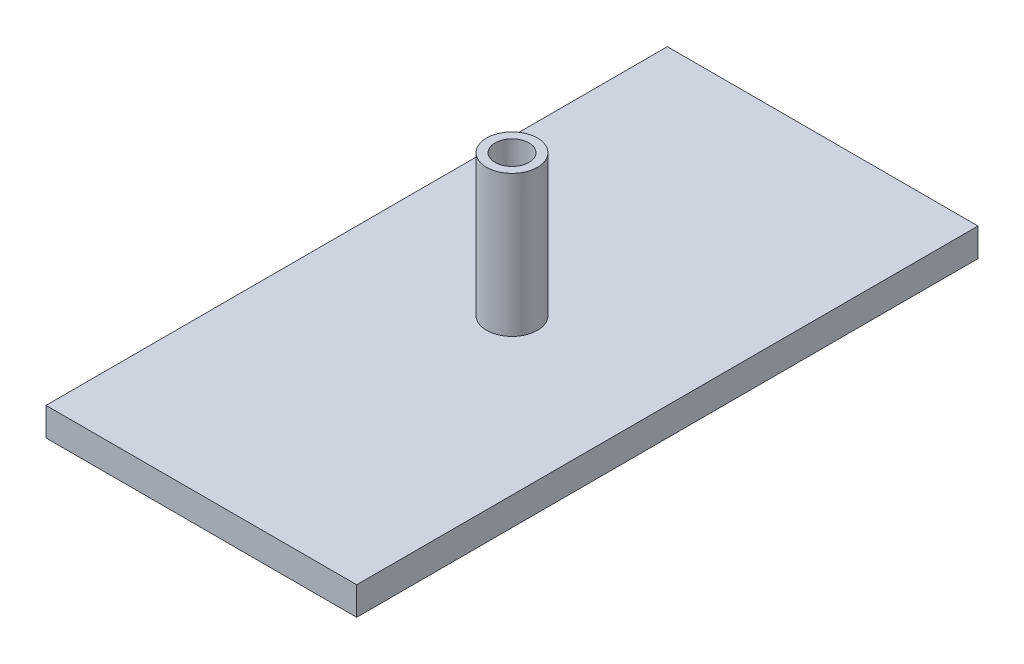
ISO-10303-21;
HEADER;
FILE_DESCRIPTION(('STEP AP214'),'2;1');
FILE_NAME('part.step','',(''),(''),'','','');
FILE_SCHEMA(('AUTOMOTIVE_DESIGN { 1 0 10303 214 1 1 1 1 }'));
ENDSEC;
DATA;
#1=APPLICATION_CONTEXT('core data for automotive mechanical design processes');
#2=APPLICATION_PROTOCOL_DEFINITION('international standard','automotive_design',2000,#1);
#3=PRODUCT_CONTEXT('',#1,'mechanical');
#4=PRODUCT('Part','Part','',(#3));
#5=PRODUCT_RELATED_PRODUCT_CATEGORY('part','',(#4));
#6=PRODUCT_DEFINITION_FORMATION('','',#4);
#7=PRODUCT_DEFINITION_CONTEXT('part definition',#1,'design');
#8=PRODUCT_DEFINITION('design','',#6,#7);
#9=PRODUCT_DEFINITION_SHAPE('','',#8);
#10=(LENGTH_UNIT() NAMED_UNIT(*) SI_UNIT(.MILLI.,.METRE.));
#11=(NAMED_UNIT(*) PLANE_ANGLE_UNIT() SI_UNIT($,.RADIAN.));
#12=(NAMED_UNIT(*) SI_UNIT($,.STERADIAN.) SOLID_ANGLE_UNIT());
#13=UNCERTAINTY_MEASURE_WITH_UNIT(LENGTH_MEASURE(1.E-05),#10,'distance_accuracy_value','');
#14=(GEOMETRIC_REPRESENTATION_CONTEXT(3) GLOBAL_UNCERTAINTY_ASSIGNED_CONTEXT((#13)) GLOBAL_UNIT_ASSIGNED_CONTEXT((#10,
#11,#12)) REPRESENTATION_CONTEXT('',''));
#15=CARTESIAN_POINT('',(0.,0.,0.));
#16=DIRECTION('',(0.,0.,1.));
#17=DIRECTION('',(1.,0.,0.));
#18=AXIS2_PLACEMENT_3D('',#15,#16,#17);
#19=CARTESIAN_POINT('',(0.,5.,0.));
#20=DIRECTION('',(-1.,0.,0.));
#21=DIRECTION('',(0.,0.,1.));
#22=AXIS2_PLACEMENT_3D('',#19,#20,#21);
#23=PLANE('',#22);
#24=DIRECTION('',(0.,0.,-1.));
#25=VECTOR('',#24,1.);
#26=CARTESIAN_POINT('',(0.,0.,0.));
#27=LINE('',#26,#25);
#28=CARTESIAN_POINT('',(0.,0.,0.));
#29=VERTEX_POINT('',#28);
#30=CARTESIAN_POINT('',(0.,0.,-110.));
#31=VERTEX_POINT('',#30);
#32=EDGE_CURVE('E105',#29,#31,#27,.T.);
#33=ORIENTED_EDGE('',*,*,#32,.F.);
#34=DIRECTION('',(0.,-1.,0.));
#35=VECTOR('',#34,1.);
#36=CARTESIAN_POINT('',(0.,5.,0.));
#37=LINE('',#36,#35);
#38=CARTESIAN_POINT('',(0.,5.,0.));
#39=VERTEX_POINT('',#38);
#40=EDGE_CURVE('E45',#39,#29,#37,.T.);
#41=ORIENTED_EDGE('',*,*,#40,.F.);
#42=DIRECTION('',(0.,0.,-1.));
#43=VECTOR('',#42,1.);
#44=CARTESIAN_POINT('',(0.,5.,0.));
#45=LINE('',#44,#43);
#46=CARTESIAN_POINT('',(0.,5.,-110.));
#47=VERTEX_POINT('',#46);
#48=EDGE_CURVE('E99',#39,#47,#45,.T.);
#49=ORIENTED_EDGE('',*,*,#48,.T.);
#50=DIRECTION('',(0.,-1.,0.));
#51=VECTOR('',#50,1.);
#52=CARTESIAN_POINT('',(0.,5.,-110.));
#53=LINE('',#52,#51);
#54=EDGE_CURVE('E77',#47,#31,#53,.T.);
#55=ORIENTED_EDGE('',*,*,#54,.T.);
#56=EDGE_LOOP('',(#33,#41,#49,#55));
#57=FACE_BOUND('',#56,.T.);
#58=ADVANCED_FACE('F37',(#57),#23,.T.);
#59=CARTESIAN_POINT('',(0.,5.,0.));
#60=DIRECTION('',(0.,0.,-1.));
#61=DIRECTION('',(-1.,0.,0.));
#62=AXIS2_PLACEMENT_3D('',#59,#60,#61);
#63=PLANE('',#62);
#64=DIRECTION('',(1.,0.,0.));
#65=VECTOR('',#64,1.);
#66=CARTESIAN_POINT('',(0.,0.,0.));
#67=LINE('',#66,#65);
#68=CARTESIAN_POINT('',(55.,0.,0.));
#69=VERTEX_POINT('',#68);
#70=EDGE_CURVE('E69',#29,#69,#67,.T.);
#71=ORIENTED_EDGE('',*,*,#70,.T.);
#72=DIRECTION('',(0.,-1.,0.));
#73=VECTOR('',#72,1.);
#74=CARTESIAN_POINT('',(55.,5.,0.));
#75=LINE('',#74,#73);
#76=CARTESIAN_POINT('',(55.,5.,0.));
#77=VERTEX_POINT('',#76);
#78=EDGE_CURVE('E96',#77,#69,#75,.T.);
#79=ORIENTED_EDGE('',*,*,#78,.F.);
#80=DIRECTION('',(1.,0.,0.));
#81=VECTOR('',#80,1.);
#82=CARTESIAN_POINT('',(0.,5.,0.));
#83=LINE('',#82,#81);
#84=EDGE_CURVE('E87',#39,#77,#83,.T.);
#85=ORIENTED_EDGE('',*,*,#84,.F.);
#86=ORIENTED_EDGE('',*,*,#40,.T.);
#87=EDGE_LOOP('',(#71,#79,#85,#86));
#88=FACE_BOUND('',#87,.T.);
#89=ADVANCED_FACE('F130',(#88),#63,.F.);
#90=CARTESIAN_POINT('',(55.,5.,0.));
#91=DIRECTION('',(-1.,0.,0.));
#92=DIRECTION('',(0.,0.,1.));
#93=AXIS2_PLACEMENT_3D('',#90,#91,#92);
#94=PLANE('',#93);
#95=DIRECTION('',(0.,0.,-1.));
#96=VECTOR('',#95,1.);
#97=CARTESIAN_POINT('',(55.,0.,0.));
#98=LINE('',#97,#96);
#99=CARTESIAN_POINT('',(55.,0.,-110.));
#100=VERTEX_POINT('',#99);
#101=EDGE_CURVE('E94',#69,#100,#98,.T.);
#102=ORIENTED_EDGE('',*,*,#101,.T.);
#103=DIRECTION('',(0.,-1.,0.));
#104=VECTOR('',#103,1.);
#105=CARTESIAN_POINT('',(55.,5.,-110.));
#106=LINE('',#105,#104);
#107=CARTESIAN_POINT('',(55.,5.,-110.));
#108=VERTEX_POINT('',#107);
#109=EDGE_CURVE('E91',#108,#100,#106,.T.);
#110=ORIENTED_EDGE('',*,*,#109,.F.);
#111=DIRECTION('',(0.,0.,-1.));
#112=VECTOR('',#111,1.);
#113=CARTESIAN_POINT('',(55.,5.,0.));
#114=LINE('',#113,#112);
#115=EDGE_CURVE('E82',#77,#108,#114,.T.);
#116=ORIENTED_EDGE('',*,*,#115,.F.);
#117=ORIENTED_EDGE('',*,*,#78,.T.);
#118=EDGE_LOOP('',(#102,#110,#116,#117));
#119=FACE_BOUND('',#118,.T.);
#120=ADVANCED_FACE('F92',(#119),#94,.F.);
#121=CARTESIAN_POINT('',(0.,5.,-110.));
#122=DIRECTION('',(0.,0.,-1.));
#123=DIRECTION('',(-1.,0.,0.));
#124=AXIS2_PLACEMENT_3D('',#121,#122,#123);
#125=PLANE('',#124);
#126=DIRECTION('',(1.,0.,0.));
#127=VECTOR('',#126,1.);
#128=CARTESIAN_POINT('',(0.,0.,-110.));
#129=LINE('',#128,#127);
#130=EDGE_CURVE('E108',#31,#100,#129,.T.);
#131=ORIENTED_EDGE('',*,*,#130,.F.);
#132=ORIENTED_EDGE('',*,*,#54,.F.);
#133=DIRECTION('',(1.,0.,0.));
#134=VECTOR('',#133,1.);
#135=CARTESIAN_POINT('',(0.,5.,-110.));
#136=LINE('',#135,#134);
#137=EDGE_CURVE('E86',#47,#108,#136,.T.);
#138=ORIENTED_EDGE('',*,*,#137,.T.);
#139=ORIENTED_EDGE('',*,*,#109,.T.);
#140=EDGE_LOOP('',(#131,#132,#138,#139));
#141=FACE_BOUND('',#140,.T.);
#142=ADVANCED_FACE('F98',(#141),#125,.T.);
#143=CARTESIAN_POINT('',(0.,5.,0.));
#144=DIRECTION('',(0.,-1.,0.));
#145=DIRECTION('',(0.,0.,-1.));
#146=AXIS2_PLACEMENT_3D('',#143,#144,#145);
#147=PLANE('',#146);
#148=CARTESIAN_POINT('',(27.5,5.,-55.));
#149=DIRECTION('',(0.,-1.,0.));
#150=DIRECTION('',(0.,0.,-1.));
#151=AXIS2_PLACEMENT_3D('',#148,#149,#150);
#152=CIRCLE('',#151,4.50000000000001);
#153=CARTESIAN_POINT('',(27.5,5.,-59.5));
#154=VERTEX_POINT('',#153);
#155=EDGE_CURVE('E11',#154,#154,#152,.F.);
#156=ORIENTED_EDGE('',*,*,#155,.F.);
#157=EDGE_LOOP('',(#156));
#158=FACE_BOUND('',#157,.T.);
#159=ORIENTED_EDGE('',*,*,#48,.F.);
#160=ORIENTED_EDGE('',*,*,#84,.T.);
#161=ORIENTED_EDGE('',*,*,#115,.T.);
#162=ORIENTED_EDGE('',*,*,#137,.F.);
#163=EDGE_LOOP('',(#159,#160,#161,#162));
#164=FACE_BOUND('',#163,.T.);
#165=ADVANCED_FACE('F85',(#158,#164),#147,.F.);
#166=CARTESIAN_POINT('',(0.,0.,0.));
#167=DIRECTION('',(0.,-1.,0.));
#168=DIRECTION('',(0.,0.,-1.));
#169=AXIS2_PLACEMENT_3D('',#166,#167,#168);
#170=PLANE('',#169);
#171=ORIENTED_EDGE('',*,*,#32,.T.);
#172=ORIENTED_EDGE('',*,*,#130,.T.);
#173=ORIENTED_EDGE('',*,*,#101,.F.);
#174=ORIENTED_EDGE('',*,*,#70,.F.);
#175=EDGE_LOOP('',(#171,#172,#173,#174));
#176=FACE_BOUND('',#175,.T.);
#177=ADVANCED_FACE('F115',(#176),#170,.T.);
#178=CARTESIAN_POINT('',(27.5,30.,-55.));
#179=DIRECTION('',(0.,-1.,0.));
#180=DIRECTION('',(0.,0.,-1.));
#181=AXIS2_PLACEMENT_3D('',#178,#179,#180);
#182=CYLINDRICAL_SURFACE('',#181,4.50000000000001);
#183=CARTESIAN_POINT('',(27.5,30.,-55.));
#184=DIRECTION('',(0.,1.,0.));
#185=DIRECTION('',(0.,0.,1.));
#186=AXIS2_PLACEMENT_3D('',#183,#184,#185);
#187=CIRCLE('',#186,4.50000000000001);
#188=CARTESIAN_POINT('',(27.5,30.,-50.5));
#189=VERTEX_POINT('',#188);
#190=EDGE_CURVE('E109',#189,#189,#187,.T.);
#191=ORIENTED_EDGE('',*,*,#190,.F.);
#192=EDGE_LOOP('',(#191));
#193=FACE_BOUND('',#192,.T.);
#194=ORIENTED_EDGE('',*,*,#155,.T.);
#195=EDGE_LOOP('',(#194));
#196=FACE_BOUND('',#195,.T.);
#197=ADVANCED_FACE('F117',(#193,#196),#182,.T.);
#198=CARTESIAN_POINT('',(27.5,30.,-55.));
#199=DIRECTION('',(0.,1.,0.));
#200=DIRECTION('',(0.,0.,1.));
#201=AXIS2_PLACEMENT_3D('',#198,#199,#200);
#202=PLANE('',#201);
#203=CARTESIAN_POINT('',(27.5,30.,-55.));
#204=DIRECTION('',(0.,1.,0.));
#205=DIRECTION('',(0.,0.,1.));
#206=AXIS2_PLACEMENT_3D('',#203,#204,#205);
#207=CIRCLE('',#206,3.);
#208=CARTESIAN_POINT('',(27.5,30.,-52.));
#209=VERTEX_POINT('',#208);
#210=EDGE_CURVE('E227',#209,#209,#207,.T.);
#211=ORIENTED_EDGE('',*,*,#210,.F.);
#212=EDGE_LOOP('',(#211));
#213=FACE_BOUND('',#212,.T.);
#214=ORIENTED_EDGE('',*,*,#190,.T.);
#215=EDGE_LOOP('',(#214));
#216=FACE_BOUND('',#215,.T.);
#217=ADVANCED_FACE('F123',(#213,#216),#202,.T.);
#218=CARTESIAN_POINT('',(27.5,10.,-55.));
#219=DIRECTION('',(0.,1.,0.));
#220=DIRECTION('',(0.,0.,1.));
#221=AXIS2_PLACEMENT_3D('',#218,#219,#220);
#222=CYLINDRICAL_SURFACE('',#221,3.);
#223=CARTESIAN_POINT('',(27.5,10.,-55.));
#224=DIRECTION('',(0.,1.,0.));
#225=DIRECTION('',(0.,0.,1.));
#226=AXIS2_PLACEMENT_3D('',#223,#224,#225);
#227=CIRCLE('',#226,3.);
#228=CARTESIAN_POINT('',(27.5,10.,-52.));
#229=VERTEX_POINT('',#228);
#230=EDGE_CURVE('E226',#229,#229,#227,.T.);
#231=ORIENTED_EDGE('',*,*,#230,.F.);
#232=EDGE_LOOP('',(#231));
#233=FACE_BOUND('',#232,.T.);
#234=ORIENTED_EDGE('',*,*,#210,.T.);
#235=EDGE_LOOP('',(#234));
#236=FACE_BOUND('',#235,.T.);
#237=ADVANCED_FACE('F166',(#233,#236),#222,.F.);
#238=CARTESIAN_POINT('',(27.5,10.,-55.));
#239=DIRECTION('',(0.,1.,0.));
#240=DIRECTION('',(0.,0.,1.));
#241=AXIS2_PLACEMENT_3D('',#238,#239,#240);
#242=PLANE('',#241);
#243=ORIENTED_EDGE('',*,*,#230,.T.);
#244=EDGE_LOOP('',(#243));
#245=FACE_BOUND('',#244,.T.);
#246=ADVANCED_FACE('F177',(#245),#242,.T.);
#247=CLOSED_SHELL('',(#58,#89,#120,#142,#165,#177,#197,#217,#237,#246));
#248=MANIFOLD_SOLID_BREP('B2',#247);
#249=ADVANCED_BREP_SHAPE_REPRESENTATION('',(#18,#248),#14);
#250=SHAPE_DEFINITION_REPRESENTATION(#9,#249);
ENDSEC;
END-ISO-10303-21;
